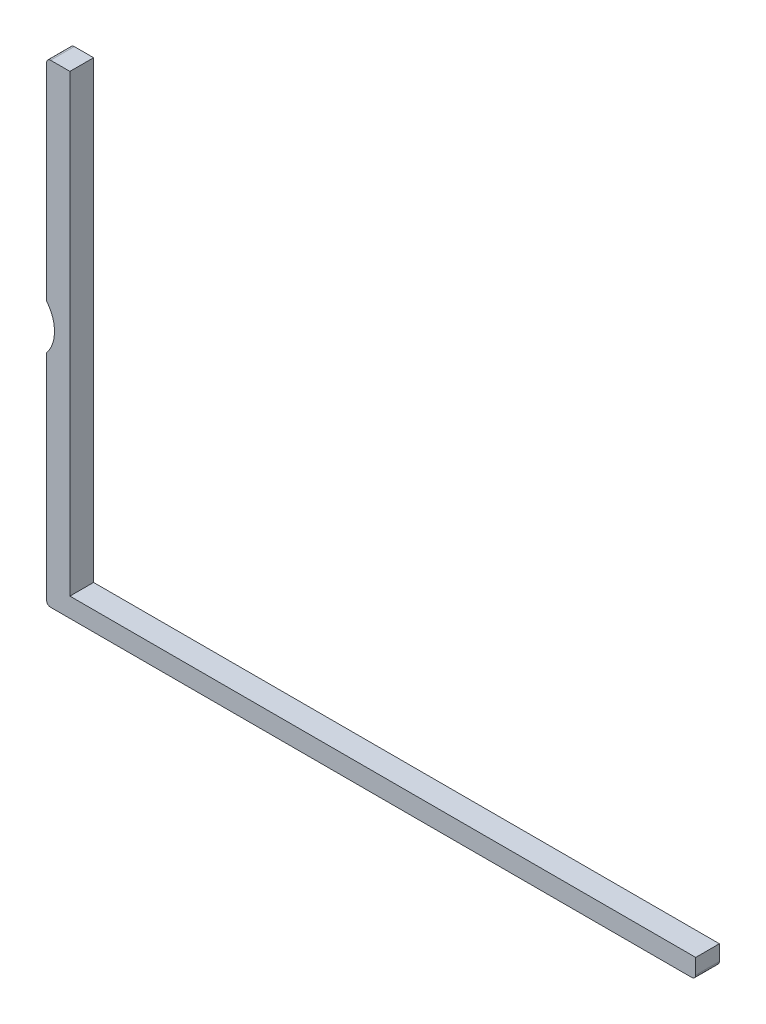
ISO-10303-21;
HEADER;
FILE_DESCRIPTION(('STEP AP214'),'2;1');
FILE_NAME('part.step','',(''),(''),'','','');
FILE_SCHEMA(('AUTOMOTIVE_DESIGN { 1 0 10303 214 1 1 1 1 }'));
ENDSEC;
DATA;
#1=APPLICATION_CONTEXT('core data for automotive mechanical design processes');
#2=APPLICATION_PROTOCOL_DEFINITION('international standard','automotive_design',2000,#1);
#3=PRODUCT_CONTEXT('',#1,'mechanical');
#4=PRODUCT('Part','Part','',(#3));
#5=PRODUCT_RELATED_PRODUCT_CATEGORY('part','',(#4));
#6=PRODUCT_DEFINITION_FORMATION('','',#4);
#7=PRODUCT_DEFINITION_CONTEXT('part definition',#1,'design');
#8=PRODUCT_DEFINITION('design','',#6,#7);
#9=PRODUCT_DEFINITION_SHAPE('','',#8);
#10=(LENGTH_UNIT() NAMED_UNIT(*) SI_UNIT(.MILLI.,.METRE.));
#11=(NAMED_UNIT(*) PLANE_ANGLE_UNIT() SI_UNIT($,.RADIAN.));
#12=(NAMED_UNIT(*) SI_UNIT($,.STERADIAN.) SOLID_ANGLE_UNIT());
#13=UNCERTAINTY_MEASURE_WITH_UNIT(LENGTH_MEASURE(1.E-05),#10,'distance_accuracy_value','');
#14=(GEOMETRIC_REPRESENTATION_CONTEXT(3) GLOBAL_UNCERTAINTY_ASSIGNED_CONTEXT((#13)) GLOBAL_UNIT_ASSIGNED_CONTEXT((#10,
#11,#12)) REPRESENTATION_CONTEXT('',''));
#15=CARTESIAN_POINT('',(0.,0.,0.));
#16=DIRECTION('',(0.,0.,1.));
#17=DIRECTION('',(1.,0.,0.));
#18=AXIS2_PLACEMENT_3D('',#15,#16,#17);
#19=CARTESIAN_POINT('',(0.,27.6715728752538,3.));
#20=DIRECTION('',(1.,0.,0.));
#21=DIRECTION('',(0.,1.,0.));
#22=AXIS2_PLACEMENT_3D('',#19,#20,#21);
#23=PLANE('',#22);
#24=DIRECTION('',(0.,-1.,0.));
#25=VECTOR('',#24,1.);
#26=CARTESIAN_POINT('',(0.,27.6715728752538,0.));
#27=LINE('',#26,#25);
#28=CARTESIAN_POINT('',(0.,27.6715728752538,0.));
#29=VERTEX_POINT('',#28);
#30=CARTESIAN_POINT('',(0.,0.5,0.));
#31=VERTEX_POINT('',#30);
#32=EDGE_CURVE('E152',#29,#31,#27,.T.);
#33=ORIENTED_EDGE('',*,*,#32,.T.);
#34=DIRECTION('',(0.,0.,-1.));
#35=VECTOR('',#34,1.);
#36=CARTESIAN_POINT('',(0.,0.5,3.));
#37=LINE('',#36,#35);
#38=CARTESIAN_POINT('',(0.,0.5,3.));
#39=VERTEX_POINT('',#38);
#40=EDGE_CURVE('E195',#31,#39,#37,.F.);
#41=ORIENTED_EDGE('',*,*,#40,.T.);
#42=DIRECTION('',(0.,-1.,0.));
#43=VECTOR('',#42,1.);
#44=CARTESIAN_POINT('',(0.,27.6715728752538,3.));
#45=LINE('',#44,#43);
#46=CARTESIAN_POINT('',(0.,27.6715728752538,3.));
#47=VERTEX_POINT('',#46);
#48=EDGE_CURVE('E169',#47,#39,#45,.T.);
#49=ORIENTED_EDGE('',*,*,#48,.F.);
#50=DIRECTION('',(0.,0.,-1.));
#51=VECTOR('',#50,1.);
#52=CARTESIAN_POINT('',(0.,27.6715728752538,3.));
#53=LINE('',#52,#51);
#54=EDGE_CURVE('E151',#47,#29,#53,.T.);
#55=ORIENTED_EDGE('',*,*,#54,.T.);
#56=EDGE_LOOP('',(#33,#41,#49,#55));
#57=FACE_BOUND('',#56,.T.);
#58=ADVANCED_FACE('F32',(#57),#23,.F.);
#59=CARTESIAN_POINT('',(0.,0.,3.));
#60=DIRECTION('',(0.,1.,0.));
#61=DIRECTION('',(0.,0.,1.));
#62=AXIS2_PLACEMENT_3D('',#59,#60,#61);
#63=PLANE('',#62);
#64=DIRECTION('',(1.,0.,0.));
#65=VECTOR('',#64,1.);
#66=CARTESIAN_POINT('',(0.,0.,0.));
#67=LINE('',#66,#65);
#68=CARTESIAN_POINT('',(0.5,0.,0.));
#69=VERTEX_POINT('',#68);
#70=CARTESIAN_POINT('',(81.7,0.,0.));
#71=VERTEX_POINT('',#70);
#72=EDGE_CURVE('E155',#69,#71,#67,.T.);
#73=ORIENTED_EDGE('',*,*,#72,.T.);
#74=DIRECTION('',(0.,0.,-1.));
#75=VECTOR('',#74,1.);
#76=CARTESIAN_POINT('',(81.7,0.,3.));
#77=LINE('',#76,#75);
#78=CARTESIAN_POINT('',(81.7,0.,3.));
#79=VERTEX_POINT('',#78);
#80=EDGE_CURVE('E189',#71,#79,#77,.F.);
#81=ORIENTED_EDGE('',*,*,#80,.T.);
#82=DIRECTION('',(1.,0.,0.));
#83=VECTOR('',#82,1.);
#84=CARTESIAN_POINT('',(0.,0.,3.));
#85=LINE('',#84,#83);
#86=CARTESIAN_POINT('',(0.5,0.,3.));
#87=VERTEX_POINT('',#86);
#88=EDGE_CURVE('E125',#87,#79,#85,.T.);
#89=ORIENTED_EDGE('',*,*,#88,.F.);
#90=DIRECTION('',(0.,0.,-1.));
#91=VECTOR('',#90,1.);
#92=CARTESIAN_POINT('',(0.5,0.,3.));
#93=LINE('',#92,#91);
#94=EDGE_CURVE('E186',#87,#69,#93,.T.);
#95=ORIENTED_EDGE('',*,*,#94,.T.);
#96=EDGE_LOOP('',(#73,#81,#89,#95));
#97=FACE_BOUND('',#96,.T.);
#98=ADVANCED_FACE('F236',(#97),#63,.F.);
#99=CARTESIAN_POINT('',(82.2,0.,3.));
#100=DIRECTION('',(-1.,0.,0.));
#101=DIRECTION('',(0.,0.,1.));
#102=AXIS2_PLACEMENT_3D('',#99,#100,#101);
#103=PLANE('',#102);
#104=DIRECTION('',(0.,1.,0.));
#105=VECTOR('',#104,1.);
#106=CARTESIAN_POINT('',(82.2,0.,3.));
#107=LINE('',#106,#105);
#108=CARTESIAN_POINT('',(82.2,0.5,3.));
#109=VERTEX_POINT('',#108);
#110=CARTESIAN_POINT('',(82.2,2.45,3.));
#111=VERTEX_POINT('',#110);
#112=EDGE_CURVE('E113',#109,#111,#107,.T.);
#113=ORIENTED_EDGE('',*,*,#112,.F.);
#114=DIRECTION('',(0.,0.,-1.));
#115=VECTOR('',#114,1.);
#116=CARTESIAN_POINT('',(82.2,0.5,3.));
#117=LINE('',#116,#115);
#118=CARTESIAN_POINT('',(82.2,0.5,0.));
#119=VERTEX_POINT('',#118);
#120=EDGE_CURVE('E134',#109,#119,#117,.T.);
#121=ORIENTED_EDGE('',*,*,#120,.T.);
#122=DIRECTION('',(0.,1.,0.));
#123=VECTOR('',#122,1.);
#124=CARTESIAN_POINT('',(82.2,0.,0.));
#125=LINE('',#124,#123);
#126=CARTESIAN_POINT('',(82.2,2.45,0.));
#127=VERTEX_POINT('',#126);
#128=EDGE_CURVE('E131',#119,#127,#125,.T.);
#129=ORIENTED_EDGE('',*,*,#128,.T.);
#130=DIRECTION('',(0.,0.,-1.));
#131=VECTOR('',#130,1.);
#132=CARTESIAN_POINT('',(82.2,2.45,3.));
#133=LINE('',#132,#131);
#134=EDGE_CURVE('E128',#111,#127,#133,.T.);
#135=ORIENTED_EDGE('',*,*,#134,.F.);
#136=EDGE_LOOP('',(#113,#121,#129,#135));
#137=FACE_BOUND('',#136,.T.);
#138=ADVANCED_FACE('F129',(#137),#103,.F.);
#139=CARTESIAN_POINT('',(82.2,2.45,3.));
#140=DIRECTION('',(0.,-1.,0.));
#141=DIRECTION('',(1.,0.,0.));
#142=AXIS2_PLACEMENT_3D('',#139,#140,#141);
#143=PLANE('',#142);
#144=DIRECTION('',(-1.,0.,0.));
#145=VECTOR('',#144,1.);
#146=CARTESIAN_POINT('',(82.2,2.45,0.));
#147=LINE('',#146,#145);
#148=CARTESIAN_POINT('',(2.94999999999999,2.44999999999999,0.));
#149=VERTEX_POINT('',#148);
#150=EDGE_CURVE('E159',#127,#149,#147,.T.);
#151=ORIENTED_EDGE('',*,*,#150,.T.);
#152=DIRECTION('',(0.,0.,-1.));
#153=VECTOR('',#152,1.);
#154=CARTESIAN_POINT('',(2.94999999999999,2.44999999999999,3.));
#155=LINE('',#154,#153);
#156=CARTESIAN_POINT('',(2.94999999999999,2.44999999999999,3.));
#157=VERTEX_POINT('',#156);
#158=EDGE_CURVE('E135',#157,#149,#155,.T.);
#159=ORIENTED_EDGE('',*,*,#158,.F.);
#160=DIRECTION('',(-1.,0.,0.));
#161=VECTOR('',#160,1.);
#162=CARTESIAN_POINT('',(82.2,2.45,3.));
#163=LINE('',#162,#161);
#164=EDGE_CURVE('E118',#111,#157,#163,.T.);
#165=ORIENTED_EDGE('',*,*,#164,.F.);
#166=ORIENTED_EDGE('',*,*,#134,.T.);
#167=EDGE_LOOP('',(#151,#159,#165,#166));
#168=FACE_BOUND('',#167,.T.);
#169=ADVANCED_FACE('F137',(#168),#143,.F.);
#170=CARTESIAN_POINT('',(2.94999999999999,2.44999999999999,3.));
#171=DIRECTION('',(-1.,0.,0.));
#172=DIRECTION('',(0.,-1.,0.));
#173=AXIS2_PLACEMENT_3D('',#170,#171,#172);
#174=PLANE('',#173);
#175=DIRECTION('',(0.,1.,0.));
#176=VECTOR('',#175,1.);
#177=CARTESIAN_POINT('',(2.94999999999999,2.44999999999999,0.));
#178=LINE('',#177,#176);
#179=CARTESIAN_POINT('',(2.95,60.,0.));
#180=VERTEX_POINT('',#179);
#181=EDGE_CURVE('E161',#149,#180,#178,.T.);
#182=ORIENTED_EDGE('',*,*,#181,.T.);
#183=DIRECTION('',(0.,0.,-1.));
#184=VECTOR('',#183,1.);
#185=CARTESIAN_POINT('',(2.95,60.,3.));
#186=LINE('',#185,#184);
#187=CARTESIAN_POINT('',(2.95,60.,3.));
#188=VERTEX_POINT('',#187);
#189=EDGE_CURVE('E175',#188,#180,#186,.T.);
#190=ORIENTED_EDGE('',*,*,#189,.F.);
#191=DIRECTION('',(0.,1.,0.));
#192=VECTOR('',#191,1.);
#193=CARTESIAN_POINT('',(2.94999999999999,2.44999999999999,3.));
#194=LINE('',#193,#192);
#195=EDGE_CURVE('E140',#157,#188,#194,.T.);
#196=ORIENTED_EDGE('',*,*,#195,.F.);
#197=ORIENTED_EDGE('',*,*,#158,.T.);
#198=EDGE_LOOP('',(#182,#190,#196,#197));
#199=FACE_BOUND('',#198,.T.);
#200=ADVANCED_FACE('F227',(#199),#174,.F.);
#201=CARTESIAN_POINT('',(2.95,60.,3.));
#202=DIRECTION('',(0.,-1.,0.));
#203=DIRECTION('',(0.,0.,-1.));
#204=AXIS2_PLACEMENT_3D('',#201,#202,#203);
#205=PLANE('',#204);
#206=DIRECTION('',(-1.,0.,0.));
#207=VECTOR('',#206,1.);
#208=CARTESIAN_POINT('',(2.95,60.,0.));
#209=LINE('',#208,#207);
#210=CARTESIAN_POINT('',(0.499999999999996,60.,0.));
#211=VERTEX_POINT('',#210);
#212=EDGE_CURVE('E163',#180,#211,#209,.T.);
#213=ORIENTED_EDGE('',*,*,#212,.T.);
#214=DIRECTION('',(0.,0.,-1.));
#215=VECTOR('',#214,1.);
#216=CARTESIAN_POINT('',(0.499999999999996,60.,3.));
#217=LINE('',#216,#215);
#218=CARTESIAN_POINT('',(0.499999999999996,60.,3.));
#219=VERTEX_POINT('',#218);
#220=EDGE_CURVE('E11',#211,#219,#217,.F.);
#221=ORIENTED_EDGE('',*,*,#220,.T.);
#222=DIRECTION('',(-1.,0.,0.));
#223=VECTOR('',#222,1.);
#224=CARTESIAN_POINT('',(2.95,60.,3.));
#225=LINE('',#224,#223);
#226=EDGE_CURVE('E142',#188,#219,#225,.T.);
#227=ORIENTED_EDGE('',*,*,#226,.F.);
#228=ORIENTED_EDGE('',*,*,#189,.T.);
#229=EDGE_LOOP('',(#213,#221,#227,#228));
#230=FACE_BOUND('',#229,.T.);
#231=ADVANCED_FACE('F258',(#230),#205,.F.);
#232=CARTESIAN_POINT('',(0.,60.,3.));
#233=DIRECTION('',(1.,0.,0.));
#234=DIRECTION('',(0.,1.,0.));
#235=AXIS2_PLACEMENT_3D('',#232,#233,#234);
#236=PLANE('',#235);
#237=DIRECTION('',(0.,-1.,0.));
#238=VECTOR('',#237,1.);
#239=CARTESIAN_POINT('',(0.,60.,3.));
#240=LINE('',#239,#238);
#241=CARTESIAN_POINT('',(0.,59.5,3.));
#242=VERTEX_POINT('',#241);
#243=CARTESIAN_POINT('',(0.,33.3284271247462,3.));
#244=VERTEX_POINT('',#243);
#245=EDGE_CURVE('E147',#242,#244,#240,.T.);
#246=ORIENTED_EDGE('',*,*,#245,.F.);
#247=DIRECTION('',(0.,0.,-1.));
#248=VECTOR('',#247,1.);
#249=CARTESIAN_POINT('',(0.,59.5,3.));
#250=LINE('',#249,#248);
#251=CARTESIAN_POINT('',(0.,59.5,0.));
#252=VERTEX_POINT('',#251);
#253=EDGE_CURVE('E40',#242,#252,#250,.T.);
#254=ORIENTED_EDGE('',*,*,#253,.T.);
#255=DIRECTION('',(0.,-1.,0.));
#256=VECTOR('',#255,1.);
#257=CARTESIAN_POINT('',(0.,60.,0.));
#258=LINE('',#257,#256);
#259=CARTESIAN_POINT('',(0.,33.3284271247462,0.));
#260=VERTEX_POINT('',#259);
#261=EDGE_CURVE('E165',#252,#260,#258,.T.);
#262=ORIENTED_EDGE('',*,*,#261,.T.);
#263=DIRECTION('',(0.,0.,-1.));
#264=VECTOR('',#263,1.);
#265=CARTESIAN_POINT('',(0.,33.3284271247462,3.));
#266=LINE('',#265,#264);
#267=EDGE_CURVE('E172',#244,#260,#266,.T.);
#268=ORIENTED_EDGE('',*,*,#267,.F.);
#269=EDGE_LOOP('',(#246,#254,#262,#268));
#270=FACE_BOUND('',#269,.T.);
#271=ADVANCED_FACE('F200',(#270),#236,.F.);
#272=CARTESIAN_POINT('',(-3.5,30.5,3.));
#273=DIRECTION('',(0.,0.,-1.));
#274=DIRECTION('',(-1.,0.,0.));
#275=AXIS2_PLACEMENT_3D('',#272,#273,#274);
#276=CYLINDRICAL_SURFACE('',#275,4.5);
#277=CARTESIAN_POINT('',(-3.5,30.5,0.));
#278=DIRECTION('',(0.,0.,-1.));
#279=DIRECTION('',(1.,0.,0.));
#280=AXIS2_PLACEMENT_3D('',#277,#278,#279);
#281=CIRCLE('',#280,4.5);
#282=EDGE_CURVE('E167',#260,#29,#281,.T.);
#283=ORIENTED_EDGE('',*,*,#282,.T.);
#284=ORIENTED_EDGE('',*,*,#54,.F.);
#285=CARTESIAN_POINT('',(-3.5,30.5,3.));
#286=DIRECTION('',(0.,0.,-1.));
#287=DIRECTION('',(1.,0.,0.));
#288=AXIS2_PLACEMENT_3D('',#285,#286,#287);
#289=CIRCLE('',#288,4.5);
#290=EDGE_CURVE('E149',#244,#47,#289,.T.);
#291=ORIENTED_EDGE('',*,*,#290,.F.);
#292=ORIENTED_EDGE('',*,*,#267,.T.);
#293=EDGE_LOOP('',(#283,#284,#291,#292));
#294=FACE_BOUND('',#293,.T.);
#295=ADVANCED_FACE('F210',(#294),#276,.F.);
#296=CARTESIAN_POINT('',(-3.5,30.5,3.));
#297=DIRECTION('',(0.,0.,1.));
#298=DIRECTION('',(1.,0.,0.));
#299=AXIS2_PLACEMENT_3D('',#296,#297,#298);
#300=PLANE('',#299);
#301=ORIENTED_EDGE('',*,*,#88,.T.);
#302=CARTESIAN_POINT('',(81.7,0.5,3.));
#303=DIRECTION('',(0.,0.,1.));
#304=DIRECTION('',(1.,0.,0.));
#305=AXIS2_PLACEMENT_3D('',#302,#303,#304);
#306=CIRCLE('',#305,0.5);
#307=EDGE_CURVE('E121',#79,#109,#306,.T.);
#308=ORIENTED_EDGE('',*,*,#307,.T.);
#309=ORIENTED_EDGE('',*,*,#112,.T.);
#310=ORIENTED_EDGE('',*,*,#164,.T.);
#311=ORIENTED_EDGE('',*,*,#195,.T.);
#312=ORIENTED_EDGE('',*,*,#226,.T.);
#313=CARTESIAN_POINT('',(0.499999999999996,59.5,3.));
#314=DIRECTION('',(0.,0.,1.));
#315=DIRECTION('',(1.,0.,0.));
#316=AXIS2_PLACEMENT_3D('',#313,#314,#315);
#317=CIRCLE('',#316,0.5);
#318=EDGE_CURVE('E47',#219,#242,#317,.T.);
#319=ORIENTED_EDGE('',*,*,#318,.T.);
#320=ORIENTED_EDGE('',*,*,#245,.T.);
#321=ORIENTED_EDGE('',*,*,#290,.T.);
#322=ORIENTED_EDGE('',*,*,#48,.T.);
#323=CARTESIAN_POINT('',(0.5,0.5,3.));
#324=DIRECTION('',(0.,0.,1.));
#325=DIRECTION('',(1.,0.,0.));
#326=AXIS2_PLACEMENT_3D('',#323,#324,#325);
#327=CIRCLE('',#326,0.5);
#328=EDGE_CURVE('E192',#39,#87,#327,.T.);
#329=ORIENTED_EDGE('',*,*,#328,.T.);
#330=EDGE_LOOP('',(#301,#308,#309,#310,#311,#312,#319,#320,#321,#322,#329));
#331=FACE_BOUND('',#330,.T.);
#332=ADVANCED_FACE('F116',(#331),#300,.T.);
#333=CARTESIAN_POINT('',(-3.5,30.5,0.));
#334=DIRECTION('',(0.,0.,1.));
#335=DIRECTION('',(1.,0.,0.));
#336=AXIS2_PLACEMENT_3D('',#333,#334,#335);
#337=PLANE('',#336);
#338=ORIENTED_EDGE('',*,*,#128,.F.);
#339=CARTESIAN_POINT('',(81.7,0.5,0.));
#340=DIRECTION('',(0.,0.,1.));
#341=DIRECTION('',(1.,0.,0.));
#342=AXIS2_PLACEMENT_3D('',#339,#340,#341);
#343=CIRCLE('',#342,0.5);
#344=EDGE_CURVE('E184',#119,#71,#343,.F.);
#345=ORIENTED_EDGE('',*,*,#344,.T.);
#346=ORIENTED_EDGE('',*,*,#72,.F.);
#347=CARTESIAN_POINT('',(0.5,0.5,0.));
#348=DIRECTION('',(0.,0.,1.));
#349=DIRECTION('',(1.,0.,0.));
#350=AXIS2_PLACEMENT_3D('',#347,#348,#349);
#351=CIRCLE('',#350,0.5);
#352=EDGE_CURVE('E182',#69,#31,#351,.F.);
#353=ORIENTED_EDGE('',*,*,#352,.T.);
#354=ORIENTED_EDGE('',*,*,#32,.F.);
#355=ORIENTED_EDGE('',*,*,#282,.F.);
#356=ORIENTED_EDGE('',*,*,#261,.F.);
#357=CARTESIAN_POINT('',(0.499999999999996,59.5,0.));
#358=DIRECTION('',(0.,0.,1.));
#359=DIRECTION('',(1.,0.,0.));
#360=AXIS2_PLACEMENT_3D('',#357,#358,#359);
#361=CIRCLE('',#360,0.5);
#362=EDGE_CURVE('E180',#252,#211,#361,.F.);
#363=ORIENTED_EDGE('',*,*,#362,.T.);
#364=ORIENTED_EDGE('',*,*,#212,.F.);
#365=ORIENTED_EDGE('',*,*,#181,.F.);
#366=ORIENTED_EDGE('',*,*,#150,.F.);
#367=EDGE_LOOP('',(#338,#345,#346,#353,#354,#355,#356,#363,#364,#365,#366));
#368=FACE_BOUND('',#367,.T.);
#369=ADVANCED_FACE('F205',(#368),#337,.F.);
#370=CARTESIAN_POINT('',(81.7,0.5,3.));
#371=DIRECTION('',(0.,0.,-1.));
#372=DIRECTION('',(-1.,0.,0.));
#373=AXIS2_PLACEMENT_3D('',#370,#371,#372);
#374=CYLINDRICAL_SURFACE('',#373,0.5);
#375=ORIENTED_EDGE('',*,*,#307,.F.);
#376=ORIENTED_EDGE('',*,*,#80,.F.);
#377=ORIENTED_EDGE('',*,*,#344,.F.);
#378=ORIENTED_EDGE('',*,*,#120,.F.);
#379=EDGE_LOOP('',(#375,#376,#377,#378));
#380=FACE_BOUND('',#379,.T.);
#381=ADVANCED_FACE('F223',(#380),#374,.T.);
#382=CARTESIAN_POINT('',(0.5,0.5,3.));
#383=DIRECTION('',(0.,0.,-1.));
#384=DIRECTION('',(-1.,0.,0.));
#385=AXIS2_PLACEMENT_3D('',#382,#383,#384);
#386=CYLINDRICAL_SURFACE('',#385,0.5);
#387=ORIENTED_EDGE('',*,*,#328,.F.);
#388=ORIENTED_EDGE('',*,*,#40,.F.);
#389=ORIENTED_EDGE('',*,*,#352,.F.);
#390=ORIENTED_EDGE('',*,*,#94,.F.);
#391=EDGE_LOOP('',(#387,#388,#389,#390));
#392=FACE_BOUND('',#391,.T.);
#393=ADVANCED_FACE('F230',(#392),#386,.T.);
#394=CARTESIAN_POINT('',(0.499999999999996,59.5,3.));
#395=DIRECTION('',(0.,0.,-1.));
#396=DIRECTION('',(-1.,0.,0.));
#397=AXIS2_PLACEMENT_3D('',#394,#395,#396);
#398=CYLINDRICAL_SURFACE('',#397,0.5);
#399=ORIENTED_EDGE('',*,*,#318,.F.);
#400=ORIENTED_EDGE('',*,*,#220,.F.);
#401=ORIENTED_EDGE('',*,*,#362,.F.);
#402=ORIENTED_EDGE('',*,*,#253,.F.);
#403=EDGE_LOOP('',(#399,#400,#401,#402));
#404=FACE_BOUND('',#403,.T.);
#405=ADVANCED_FACE('F34',(#404),#398,.T.);
#406=CLOSED_SHELL('',(#58,#98,#138,#169,#200,#231,#271,#295,#332,#369,#381,#393,#405));
#407=MANIFOLD_SOLID_BREP('B2',#406);
#408=ADVANCED_BREP_SHAPE_REPRESENTATION('',(#18,#407),#14);
#409=SHAPE_DEFINITION_REPRESENTATION(#9,#408);
ENDSEC;
END-ISO-10303-21;
